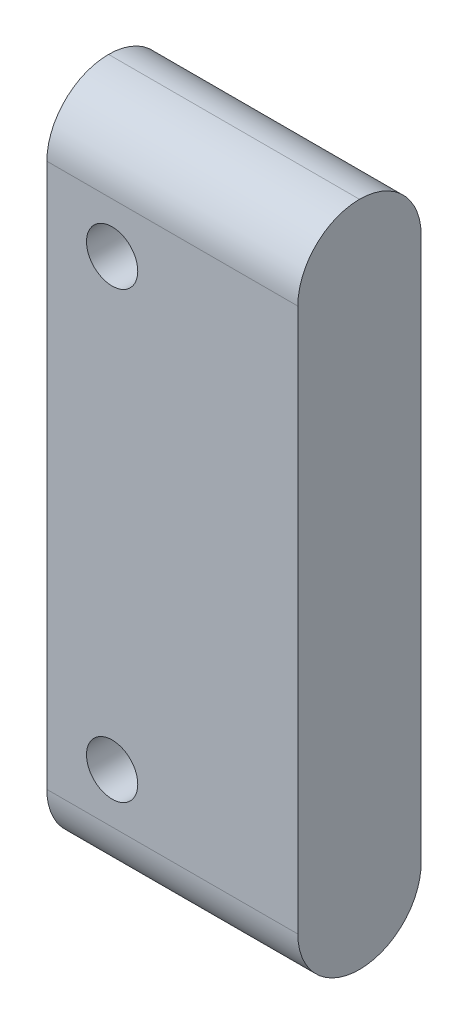
ISO-10303-21;
HEADER;
FILE_DESCRIPTION(('STEP AP214'),'2;1');
FILE_NAME('part.step','',(''),(''),'','','');
FILE_SCHEMA(('AUTOMOTIVE_DESIGN { 1 0 10303 214 1 1 1 1 }'));
ENDSEC;
DATA;
#1=APPLICATION_CONTEXT('core data for automotive mechanical design processes');
#2=APPLICATION_PROTOCOL_DEFINITION('international standard','automotive_design',2000,#1);
#3=PRODUCT_CONTEXT('',#1,'mechanical');
#4=PRODUCT('Part','Part','',(#3));
#5=PRODUCT_RELATED_PRODUCT_CATEGORY('part','',(#4));
#6=PRODUCT_DEFINITION_FORMATION('','',#4);
#7=PRODUCT_DEFINITION_CONTEXT('part definition',#1,'design');
#8=PRODUCT_DEFINITION('design','',#6,#7);
#9=PRODUCT_DEFINITION_SHAPE('','',#8);
#10=(LENGTH_UNIT() NAMED_UNIT(*) SI_UNIT(.MILLI.,.METRE.));
#11=(NAMED_UNIT(*) PLANE_ANGLE_UNIT() SI_UNIT($,.RADIAN.));
#12=(NAMED_UNIT(*) SI_UNIT($,.STERADIAN.) SOLID_ANGLE_UNIT());
#13=UNCERTAINTY_MEASURE_WITH_UNIT(LENGTH_MEASURE(1.E-05),#10,'distance_accuracy_value','');
#14=(GEOMETRIC_REPRESENTATION_CONTEXT(3) GLOBAL_UNCERTAINTY_ASSIGNED_CONTEXT((#13)) GLOBAL_UNIT_ASSIGNED_CONTEXT((#10,
#11,#12)) REPRESENTATION_CONTEXT('',''));
#15=CARTESIAN_POINT('',(0.,0.,0.));
#16=DIRECTION('',(0.,0.,1.));
#17=DIRECTION('',(1.,0.,0.));
#18=AXIS2_PLACEMENT_3D('',#15,#16,#17);
#19=CARTESIAN_POINT('',(98.8183698,88.3592086,-15.875));
#20=DIRECTION('',(-1.,0.,0.));
#21=DIRECTION('',(0.,0.,1.));
#22=AXIS2_PLACEMENT_3D('',#19,#20,#21);
#23=PLANE('',#22);
#24=DIRECTION('',(0.,-1.,0.));
#25=VECTOR('',#24,1.);
#26=CARTESIAN_POINT('',(98.8183698,88.3592086,-15.875));
#27=LINE('',#26,#25);
#28=CARTESIAN_POINT('',(98.8183698,166.3216892,-15.875));
#29=VERTEX_POINT('',#28);
#30=CARTESIAN_POINT('',(98.8183698,96.2967121223245,-15.875));
#31=VERTEX_POINT('',#30);
#32=EDGE_CURVE('E99',#29,#31,#27,.T.);
#33=ORIENTED_EDGE('',*,*,#32,.T.);
#34=CARTESIAN_POINT('',(98.8183698,96.2967121223245,-7.9375));
#35=DIRECTION('',(-1.,0.,0.));
#36=DIRECTION('',(0.,1.,0.));
#37=AXIS2_PLACEMENT_3D('',#34,#35,#36);
#38=ELLIPSE('',#37,7.93750352232446,7.9375);
#39=CARTESIAN_POINT('',(98.8183698,88.3592086,-7.9375));
#40=VERTEX_POINT('',#39);
#41=EDGE_CURVE('E48',#31,#40,#38,.T.);
#42=ORIENTED_EDGE('',*,*,#41,.T.);
#43=CARTESIAN_POINT('',(98.8183698,96.2967121223245,-7.9375));
#44=DIRECTION('',(-1.,0.,0.));
#45=DIRECTION('',(0.,-1.,0.));
#46=AXIS2_PLACEMENT_3D('',#43,#44,#45);
#47=ELLIPSE('',#46,7.93750352232446,7.9375);
#48=CARTESIAN_POINT('',(98.8183698,96.2967121223245,0.));
#49=VERTEX_POINT('',#48);
#50=EDGE_CURVE('E121',#40,#49,#47,.T.);
#51=ORIENTED_EDGE('',*,*,#50,.T.);
#52=DIRECTION('',(0.,-1.,0.));
#53=VECTOR('',#52,1.);
#54=CARTESIAN_POINT('',(98.8183698,88.3592086,0.));
#55=LINE('',#54,#53);
#56=CARTESIAN_POINT('',(98.8183698,166.3216892,0.));
#57=VERTEX_POINT('',#56);
#58=EDGE_CURVE('E90',#57,#49,#55,.T.);
#59=ORIENTED_EDGE('',*,*,#58,.F.);
#60=CARTESIAN_POINT('',(98.8183698,166.3216892,-7.9375));
#61=DIRECTION('',(-1.,0.,0.));
#62=DIRECTION('',(0.,0.,1.));
#63=AXIS2_PLACEMENT_3D('',#60,#61,#62);
#64=CIRCLE('',#63,7.9375);
#65=CARTESIAN_POINT('',(98.8183698,174.2591892,-7.9375));
#66=VERTEX_POINT('',#65);
#67=EDGE_CURVE('E55',#57,#66,#64,.T.);
#68=ORIENTED_EDGE('',*,*,#67,.T.);
#69=CARTESIAN_POINT('',(98.8183698,166.3216892,-7.9375));
#70=DIRECTION('',(-1.,0.,0.));
#71=DIRECTION('',(0.,0.,1.));
#72=AXIS2_PLACEMENT_3D('',#69,#70,#71);
#73=CIRCLE('',#72,7.9375);
#74=EDGE_CURVE('E119',#66,#29,#73,.T.);
#75=ORIENTED_EDGE('',*,*,#74,.T.);
#76=EDGE_LOOP('',(#33,#42,#51,#59,#68,#75));
#77=FACE_BOUND('',#76,.T.);
#78=ADVANCED_FACE('F31',(#77),#23,.T.);
#79=CARTESIAN_POINT('',(131.1183814,174.2591892,-15.875));
#80=DIRECTION('',(1.,0.,0.));
#81=DIRECTION('',(0.,0.,-1.));
#82=AXIS2_PLACEMENT_3D('',#79,#80,#81);
#83=PLANE('',#82);
#84=CARTESIAN_POINT('',(131.1183814,96.3271413223245,-7.9375));
#85=DIRECTION('',(1.,0.,0.));
#86=DIRECTION('',(0.,-1.,0.));
#87=AXIS2_PLACEMENT_3D('',#84,#85,#86);
#88=ELLIPSE('',#87,7.93750352232446,7.9375);
#89=CARTESIAN_POINT('',(131.1183814,96.3271413223245,0.));
#90=VERTEX_POINT('',#89);
#91=CARTESIAN_POINT('',(131.1183814,88.3896378,-7.9375));
#92=VERTEX_POINT('',#91);
#93=EDGE_CURVE('E95',#90,#92,#88,.T.);
#94=ORIENTED_EDGE('',*,*,#93,.T.);
#95=CARTESIAN_POINT('',(131.1183814,96.3271413223245,-7.9375));
#96=DIRECTION('',(1.,0.,0.));
#97=DIRECTION('',(0.,1.,0.));
#98=AXIS2_PLACEMENT_3D('',#95,#96,#97);
#99=ELLIPSE('',#98,7.93750352232446,7.9375);
#100=CARTESIAN_POINT('',(131.1183814,96.3271413223245,-15.875));
#101=VERTEX_POINT('',#100);
#102=EDGE_CURVE('E105',#92,#101,#99,.T.);
#103=ORIENTED_EDGE('',*,*,#102,.T.);
#104=DIRECTION('',(0.,1.,0.));
#105=VECTOR('',#104,1.);
#106=CARTESIAN_POINT('',(131.1183814,174.2591892,-15.875));
#107=LINE('',#106,#105);
#108=CARTESIAN_POINT('',(131.1183814,166.3216892,-15.875));
#109=VERTEX_POINT('',#108);
#110=EDGE_CURVE('E135',#101,#109,#107,.T.);
#111=ORIENTED_EDGE('',*,*,#110,.T.);
#112=CARTESIAN_POINT('',(131.1183814,166.3216892,-7.9375));
#113=DIRECTION('',(1.,0.,0.));
#114=DIRECTION('',(0.,0.,-1.));
#115=AXIS2_PLACEMENT_3D('',#112,#113,#114);
#116=CIRCLE('',#115,7.9375);
#117=CARTESIAN_POINT('',(131.1183814,174.2591892,-7.9375));
#118=VERTEX_POINT('',#117);
#119=EDGE_CURVE('E106',#109,#118,#116,.T.);
#120=ORIENTED_EDGE('',*,*,#119,.T.);
#121=CARTESIAN_POINT('',(131.1183814,166.3216892,-7.9375));
#122=DIRECTION('',(1.,0.,0.));
#123=DIRECTION('',(0.,0.,-1.));
#124=AXIS2_PLACEMENT_3D('',#121,#122,#123);
#125=CIRCLE('',#124,7.9375);
#126=CARTESIAN_POINT('',(131.1183814,166.3216892,0.));
#127=VERTEX_POINT('',#126);
#128=EDGE_CURVE('E98',#118,#127,#125,.T.);
#129=ORIENTED_EDGE('',*,*,#128,.T.);
#130=DIRECTION('',(0.,1.,0.));
#131=VECTOR('',#130,1.);
#132=CARTESIAN_POINT('',(131.1183814,174.2591892,0.));
#133=LINE('',#132,#131);
#134=EDGE_CURVE('E88',#90,#127,#133,.T.);
#135=ORIENTED_EDGE('',*,*,#134,.F.);
#136=EDGE_LOOP('',(#94,#103,#111,#120,#129,#135));
#137=FACE_BOUND('',#136,.T.);
#138=ADVANCED_FACE('F94',(#137),#83,.T.);
#139=CARTESIAN_POINT('',(98.8183698,174.2591892,-15.875));
#140=DIRECTION('',(0.,0.,-1.));
#141=DIRECTION('',(-1.,0.,0.));
#142=AXIS2_PLACEMENT_3D('',#139,#140,#141);
#143=PLANE('',#142);
#144=CARTESIAN_POINT('',(107.2183784,159.9092052,-15.875));
#145=DIRECTION('',(0.,0.,1.));
#146=DIRECTION('',(1.,0.,0.));
#147=AXIS2_PLACEMENT_3D('',#144,#145,#146);
#148=CIRCLE('',#147,3.29999340000001);
#149=CARTESIAN_POINT('',(110.5183718,159.9092052,-15.875));
#150=VERTEX_POINT('',#149);
#151=EDGE_CURVE('E127',#150,#150,#148,.T.);
#152=ORIENTED_EDGE('',*,*,#151,.T.);
#153=EDGE_LOOP('',(#152));
#154=FACE_BOUND('',#153,.T.);
#155=CARTESIAN_POINT('',(107.2183784,102.7091926,-15.875));
#156=DIRECTION('',(0.,0.,1.));
#157=DIRECTION('',(1.,0.,0.));
#158=AXIS2_PLACEMENT_3D('',#155,#156,#157);
#159=CIRCLE('',#158,3.29999340000001);
#160=CARTESIAN_POINT('',(110.5183718,102.7091926,-15.875));
#161=VERTEX_POINT('',#160);
#162=EDGE_CURVE('E139',#161,#161,#159,.T.);
#163=ORIENTED_EDGE('',*,*,#162,.T.);
#164=EDGE_LOOP('',(#163));
#165=FACE_BOUND('',#164,.T.);
#166=ORIENTED_EDGE('',*,*,#110,.F.);
#167=DIRECTION('',(0.999999556242784,0.000942079738969013,0.));
#168=VECTOR('',#167,1.);
#169=CARTESIAN_POINT('',(98.8918166374621,96.2967813151326,-15.875));
#170=LINE('',#169,#168);
#171=EDGE_CURVE('E115',#101,#31,#170,.F.);
#172=ORIENTED_EDGE('',*,*,#171,.T.);
#173=ORIENTED_EDGE('',*,*,#32,.F.);
#174=DIRECTION('',(-1.,0.,0.));
#175=VECTOR('',#174,1.);
#176=CARTESIAN_POINT('',(98.8183698,166.3216892,-15.875));
#177=LINE('',#176,#175);
#178=EDGE_CURVE('E108',#29,#109,#177,.F.);
#179=ORIENTED_EDGE('',*,*,#178,.T.);
#180=EDGE_LOOP('',(#166,#172,#173,#179));
#181=FACE_BOUND('',#180,.T.);
#182=ADVANCED_FACE('F150',(#154,#165,#181),#143,.T.);
#183=CARTESIAN_POINT('',(98.8183698,174.2591892,0.));
#184=DIRECTION('',(0.,0.,-1.));
#185=DIRECTION('',(-1.,0.,0.));
#186=AXIS2_PLACEMENT_3D('',#183,#184,#185);
#187=PLANE('',#186);
#188=CARTESIAN_POINT('',(107.2183784,159.9092052,0.));
#189=DIRECTION('',(0.,0.,1.));
#190=DIRECTION('',(1.,0.,0.));
#191=AXIS2_PLACEMENT_3D('',#188,#189,#190);
#192=CIRCLE('',#191,3.29999340000001);
#193=CARTESIAN_POINT('',(110.5183718,159.9092052,0.));
#194=VERTEX_POINT('',#193);
#195=EDGE_CURVE('E124',#194,#194,#192,.T.);
#196=ORIENTED_EDGE('',*,*,#195,.F.);
#197=EDGE_LOOP('',(#196));
#198=FACE_BOUND('',#197,.T.);
#199=CARTESIAN_POINT('',(107.2183784,102.7091926,0.));
#200=DIRECTION('',(0.,0.,1.));
#201=DIRECTION('',(1.,0.,0.));
#202=AXIS2_PLACEMENT_3D('',#199,#200,#201);
#203=CIRCLE('',#202,3.29999340000001);
#204=CARTESIAN_POINT('',(110.5183718,102.7091926,0.));
#205=VERTEX_POINT('',#204);
#206=EDGE_CURVE('E142',#205,#205,#203,.T.);
#207=ORIENTED_EDGE('',*,*,#206,.F.);
#208=EDGE_LOOP('',(#207));
#209=FACE_BOUND('',#208,.T.);
#210=ORIENTED_EDGE('',*,*,#58,.T.);
#211=DIRECTION('',(0.999999556242784,0.000942079738969013,0.));
#212=VECTOR('',#211,1.);
#213=CARTESIAN_POINT('',(131.110903642072,96.3271342776771,0.));
#214=LINE('',#213,#212);
#215=EDGE_CURVE('E11',#49,#90,#214,.T.);
#216=ORIENTED_EDGE('',*,*,#215,.T.);
#217=ORIENTED_EDGE('',*,*,#134,.T.);
#218=DIRECTION('',(-1.,0.,0.));
#219=VECTOR('',#218,1.);
#220=CARTESIAN_POINT('',(98.8183698,166.3216892,0.));
#221=LINE('',#220,#219);
#222=EDGE_CURVE('E40',#127,#57,#221,.T.);
#223=ORIENTED_EDGE('',*,*,#222,.T.);
#224=EDGE_LOOP('',(#210,#216,#217,#223));
#225=FACE_BOUND('',#224,.T.);
#226=ADVANCED_FACE('F87',(#198,#209,#225),#187,.F.);
#227=CARTESIAN_POINT('',(107.2183784,102.7091926,-15.875));
#228=DIRECTION('',(0.,0.,1.));
#229=DIRECTION('',(1.,0.,0.));
#230=AXIS2_PLACEMENT_3D('',#227,#228,#229);
#231=CYLINDRICAL_SURFACE('',#230,3.29999340000001);
#232=ORIENTED_EDGE('',*,*,#162,.F.);
#233=EDGE_LOOP('',(#232));
#234=FACE_BOUND('',#233,.T.);
#235=ORIENTED_EDGE('',*,*,#206,.T.);
#236=EDGE_LOOP('',(#235));
#237=FACE_BOUND('',#236,.T.);
#238=ADVANCED_FACE('F156',(#234,#237),#231,.F.);
#239=CARTESIAN_POINT('',(107.2183784,159.9092052,-15.875));
#240=DIRECTION('',(0.,0.,1.));
#241=DIRECTION('',(1.,0.,0.));
#242=AXIS2_PLACEMENT_3D('',#239,#240,#241);
#243=CYLINDRICAL_SURFACE('',#242,3.29999340000001);
#244=ORIENTED_EDGE('',*,*,#151,.F.);
#245=EDGE_LOOP('',(#244));
#246=FACE_BOUND('',#245,.T.);
#247=ORIENTED_EDGE('',*,*,#195,.T.);
#248=EDGE_LOOP('',(#247));
#249=FACE_BOUND('',#248,.T.);
#250=ADVANCED_FACE('F153',(#246,#249),#243,.F.);
#251=CARTESIAN_POINT('',(98.8918166374621,96.2967813151326,-7.9375));
#252=DIRECTION('',(-0.999999556242784,-0.000942079738969013,0.));
#253=DIRECTION('',(0.000942079738969013,-0.999999556242784,0.));
#254=AXIS2_PLACEMENT_3D('',#251,#252,#253);
#255=CYLINDRICAL_SURFACE('',#254,7.9375);
#256=ORIENTED_EDGE('',*,*,#215,.F.);
#257=ORIENTED_EDGE('',*,*,#50,.F.);
#258=DIRECTION('',(0.999999556242784,0.000942079738969013,0.));
#259=VECTOR('',#258,1.);
#260=CARTESIAN_POINT('',(98.8183698,88.3592086,-7.9375));
#261=LINE('',#260,#259);
#262=EDGE_CURVE('E103',#92,#40,#261,.F.);
#263=ORIENTED_EDGE('',*,*,#262,.F.);
#264=ORIENTED_EDGE('',*,*,#93,.F.);
#265=EDGE_LOOP('',(#256,#257,#263,#264));
#266=FACE_BOUND('',#265,.T.);
#267=ADVANCED_FACE('F101',(#266),#255,.T.);
#268=CARTESIAN_POINT('',(131.110903642072,96.3271342776771,-7.9375));
#269=DIRECTION('',(0.999999556242784,0.000942079738969013,0.));
#270=DIRECTION('',(-0.000942079738969013,0.999999556242784,0.));
#271=AXIS2_PLACEMENT_3D('',#268,#269,#270);
#272=CYLINDRICAL_SURFACE('',#271,7.9375);
#273=ORIENTED_EDGE('',*,*,#41,.F.);
#274=ORIENTED_EDGE('',*,*,#171,.F.);
#275=ORIENTED_EDGE('',*,*,#102,.F.);
#276=ORIENTED_EDGE('',*,*,#262,.T.);
#277=EDGE_LOOP('',(#273,#274,#275,#276));
#278=FACE_BOUND('',#277,.T.);
#279=ADVANCED_FACE('F179',(#278),#272,.T.);
#280=CARTESIAN_POINT('',(98.8183698,166.3216892,-7.9375));
#281=DIRECTION('',(1.,0.,0.));
#282=DIRECTION('',(0.,0.,-1.));
#283=AXIS2_PLACEMENT_3D('',#280,#281,#282);
#284=CYLINDRICAL_SURFACE('',#283,7.9375);
#285=ORIENTED_EDGE('',*,*,#222,.F.);
#286=ORIENTED_EDGE('',*,*,#128,.F.);
#287=DIRECTION('',(-1.,0.,0.));
#288=VECTOR('',#287,1.);
#289=CARTESIAN_POINT('',(131.1183814,174.2591892,-7.9375));
#290=LINE('',#289,#288);
#291=EDGE_CURVE('E35',#66,#118,#290,.F.);
#292=ORIENTED_EDGE('',*,*,#291,.F.);
#293=ORIENTED_EDGE('',*,*,#67,.F.);
#294=EDGE_LOOP('',(#285,#286,#292,#293));
#295=FACE_BOUND('',#294,.T.);
#296=ADVANCED_FACE('F33',(#295),#284,.T.);
#297=CARTESIAN_POINT('',(98.8183698,166.3216892,-7.9375));
#298=DIRECTION('',(-1.,0.,0.));
#299=DIRECTION('',(0.,0.,1.));
#300=AXIS2_PLACEMENT_3D('',#297,#298,#299);
#301=CYLINDRICAL_SURFACE('',#300,7.9375);
#302=ORIENTED_EDGE('',*,*,#119,.F.);
#303=ORIENTED_EDGE('',*,*,#178,.F.);
#304=ORIENTED_EDGE('',*,*,#74,.F.);
#305=ORIENTED_EDGE('',*,*,#291,.T.);
#306=EDGE_LOOP('',(#302,#303,#304,#305));
#307=FACE_BOUND('',#306,.T.);
#308=ADVANCED_FACE('F132',(#307),#301,.T.);
#309=CLOSED_SHELL('',(#78,#138,#182,#226,#238,#250,#267,#279,#296,#308));
#310=MANIFOLD_SOLID_BREP('B2',#309);
#311=ADVANCED_BREP_SHAPE_REPRESENTATION('',(#18,#310),#14);
#312=SHAPE_DEFINITION_REPRESENTATION(#9,#311);
ENDSEC;
END-ISO-10303-21;
